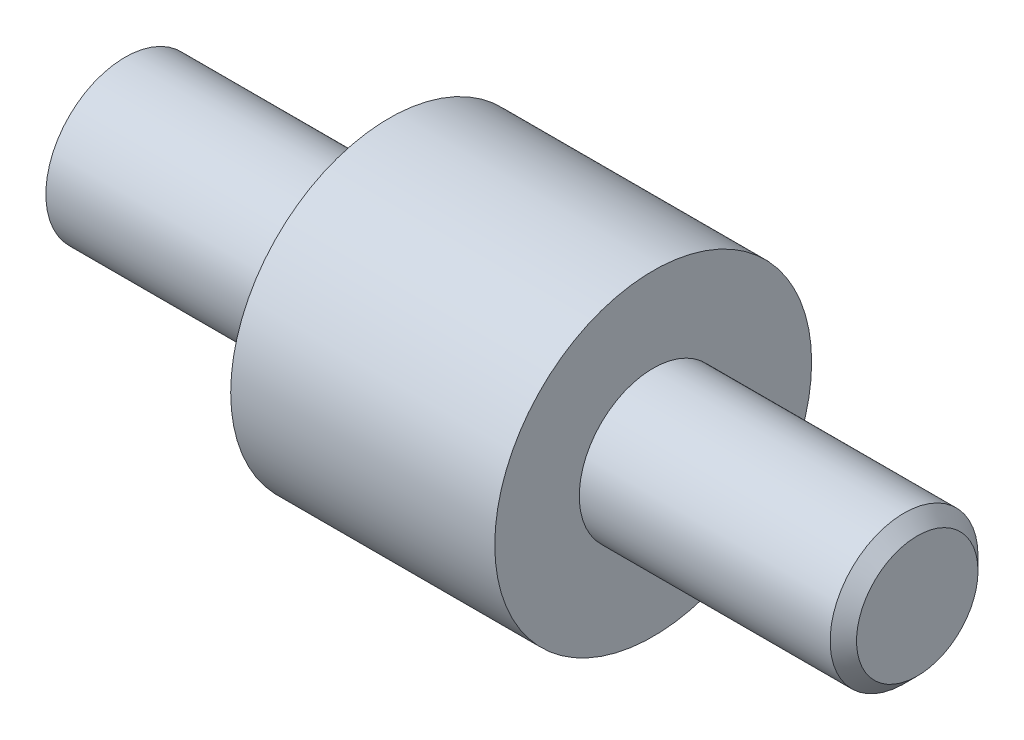
ISO-10303-21;
HEADER;
FILE_DESCRIPTION(('STEP AP214'),'2;1');
FILE_NAME('part.step','',(''),(''),'','','');
FILE_SCHEMA(('AUTOMOTIVE_DESIGN { 1 0 10303 214 1 1 1 1 }'));
ENDSEC;
DATA;
#1=APPLICATION_CONTEXT('core data for automotive mechanical design processes');
#2=APPLICATION_PROTOCOL_DEFINITION('international standard','automotive_design',2000,#1);
#3=PRODUCT_CONTEXT('',#1,'mechanical');
#4=PRODUCT('Part','Part','',(#3));
#5=PRODUCT_RELATED_PRODUCT_CATEGORY('part','',(#4));
#6=PRODUCT_DEFINITION_FORMATION('','',#4);
#7=PRODUCT_DEFINITION_CONTEXT('part definition',#1,'design');
#8=PRODUCT_DEFINITION('design','',#6,#7);
#9=PRODUCT_DEFINITION_SHAPE('','',#8);
#10=(LENGTH_UNIT() NAMED_UNIT(*) SI_UNIT(.MILLI.,.METRE.));
#11=(NAMED_UNIT(*) PLANE_ANGLE_UNIT() SI_UNIT($,.RADIAN.));
#12=(NAMED_UNIT(*) SI_UNIT($,.STERADIAN.) SOLID_ANGLE_UNIT());
#13=UNCERTAINTY_MEASURE_WITH_UNIT(LENGTH_MEASURE(1.E-05),#10,'distance_accuracy_value','');
#14=(GEOMETRIC_REPRESENTATION_CONTEXT(3) GLOBAL_UNCERTAINTY_ASSIGNED_CONTEXT((#13)) GLOBAL_UNIT_ASSIGNED_CONTEXT((#10,
#11,#12)) REPRESENTATION_CONTEXT('',''));
#15=CARTESIAN_POINT('',(0.,0.,0.));
#16=DIRECTION('',(0.,0.,1.));
#17=DIRECTION('',(1.,0.,0.));
#18=AXIS2_PLACEMENT_3D('',#15,#16,#17);
#19=CARTESIAN_POINT('',(0.,0.,0.));
#20=DIRECTION('',(-1.,0.,0.));
#21=DIRECTION('',(0.,0.,1.));
#22=AXIS2_PLACEMENT_3D('',#19,#20,#21);
#23=PLANE('',#22);
#24=CARTESIAN_POINT('',(0.,0.,0.));
#25=DIRECTION('',(1.,0.,0.));
#26=DIRECTION('',(0.,0.,-1.));
#27=AXIS2_PLACEMENT_3D('',#24,#25,#26);
#28=CIRCLE('',#27,1.5);
#29=CARTESIAN_POINT('',(0.,0.,-1.5));
#30=VERTEX_POINT('',#29);
#31=EDGE_CURVE('E45',#30,#30,#28,.T.);
#32=ORIENTED_EDGE('',*,*,#31,.F.);
#33=EDGE_LOOP('',(#32));
#34=FACE_BOUND('',#33,.T.);
#35=ADVANCED_FACE('F33',(#34),#23,.T.);
#36=CARTESIAN_POINT('',(15.,0.,0.));
#37=DIRECTION('',(1.,0.,0.));
#38=DIRECTION('',(0.,0.,-1.));
#39=AXIS2_PLACEMENT_3D('',#36,#37,#38);
#40=CYLINDRICAL_SURFACE('',#39,1.5);
#41=ORIENTED_EDGE('',*,*,#31,.T.);
#42=EDGE_LOOP('',(#41));
#43=FACE_BOUND('',#42,.T.);
#44=CARTESIAN_POINT('',(5.,0.,0.));
#45=DIRECTION('',(1.,0.,0.));
#46=DIRECTION('',(0.,0.,-1.));
#47=AXIS2_PLACEMENT_3D('',#44,#45,#46);
#48=CIRCLE('',#47,1.5);
#49=CARTESIAN_POINT('',(5.,0.,-1.5));
#50=VERTEX_POINT('',#49);
#51=EDGE_CURVE('E49',#50,#50,#48,.T.);
#52=ORIENTED_EDGE('',*,*,#51,.F.);
#53=EDGE_LOOP('',(#52));
#54=FACE_BOUND('',#53,.T.);
#55=ADVANCED_FACE('F81',(#43,#54),#40,.T.);
#56=CARTESIAN_POINT('',(5.,1.5,0.));
#57=DIRECTION('',(-1.,0.,0.));
#58=DIRECTION('',(0.,0.,1.));
#59=AXIS2_PLACEMENT_3D('',#56,#57,#58);
#60=PLANE('',#59);
#61=ORIENTED_EDGE('',*,*,#51,.T.);
#62=EDGE_LOOP('',(#61));
#63=FACE_BOUND('',#62,.T.);
#64=CARTESIAN_POINT('',(5.,0.,0.));
#65=DIRECTION('',(1.,0.,0.));
#66=DIRECTION('',(0.,0.,-1.));
#67=AXIS2_PLACEMENT_3D('',#64,#65,#66);
#68=CIRCLE('',#67,3.);
#69=CARTESIAN_POINT('',(5.,0.,-3.));
#70=VERTEX_POINT('',#69);
#71=EDGE_CURVE('E54',#70,#70,#68,.T.);
#72=ORIENTED_EDGE('',*,*,#71,.F.);
#73=EDGE_LOOP('',(#72));
#74=FACE_BOUND('',#73,.T.);
#75=ADVANCED_FACE('F77',(#63,#74),#60,.T.);
#76=CARTESIAN_POINT('',(15.,0.,0.));
#77=DIRECTION('',(1.,0.,0.));
#78=DIRECTION('',(0.,0.,-1.));
#79=AXIS2_PLACEMENT_3D('',#76,#77,#78);
#80=CYLINDRICAL_SURFACE('',#79,3.);
#81=ORIENTED_EDGE('',*,*,#71,.T.);
#82=EDGE_LOOP('',(#81));
#83=FACE_BOUND('',#82,.T.);
#84=CARTESIAN_POINT('',(10.,0.,0.));
#85=DIRECTION('',(1.,0.,0.));
#86=DIRECTION('',(0.,0.,-1.));
#87=AXIS2_PLACEMENT_3D('',#84,#85,#86);
#88=CIRCLE('',#87,3.);
#89=CARTESIAN_POINT('',(10.,0.,-3.));
#90=VERTEX_POINT('',#89);
#91=EDGE_CURVE('E57',#90,#90,#88,.T.);
#92=ORIENTED_EDGE('',*,*,#91,.F.);
#93=EDGE_LOOP('',(#92));
#94=FACE_BOUND('',#93,.T.);
#95=ADVANCED_FACE('F68',(#83,#94),#80,.T.);
#96=CARTESIAN_POINT('',(10.,3.,0.));
#97=DIRECTION('',(1.,0.,0.));
#98=DIRECTION('',(0.,0.,-1.));
#99=AXIS2_PLACEMENT_3D('',#96,#97,#98);
#100=PLANE('',#99);
#101=ORIENTED_EDGE('',*,*,#91,.T.);
#102=EDGE_LOOP('',(#101));
#103=FACE_BOUND('',#102,.T.);
#104=CARTESIAN_POINT('',(10.,0.,0.));
#105=DIRECTION('',(1.,0.,0.));
#106=DIRECTION('',(0.,0.,-1.));
#107=AXIS2_PLACEMENT_3D('',#104,#105,#106);
#108=CIRCLE('',#107,1.4);
#109=CARTESIAN_POINT('',(10.,0.,-1.4));
#110=VERTEX_POINT('',#109);
#111=EDGE_CURVE('E60',#110,#110,#108,.T.);
#112=ORIENTED_EDGE('',*,*,#111,.F.);
#113=EDGE_LOOP('',(#112));
#114=FACE_BOUND('',#113,.T.);
#115=ADVANCED_FACE('F66',(#103,#114),#100,.T.);
#116=CARTESIAN_POINT('',(15.,0.,0.));
#117=DIRECTION('',(1.,0.,0.));
#118=DIRECTION('',(0.,0.,-1.));
#119=AXIS2_PLACEMENT_3D('',#116,#117,#118);
#120=CYLINDRICAL_SURFACE('',#119,1.4);
#121=CARTESIAN_POINT('',(14.75,0.,0.));
#122=DIRECTION('',(1.,0.,0.));
#123=DIRECTION('',(0.,0.,-1.));
#124=AXIS2_PLACEMENT_3D('',#121,#122,#123);
#125=CIRCLE('',#124,1.4);
#126=CARTESIAN_POINT('',(14.75,0.,-1.4));
#127=VERTEX_POINT('',#126);
#128=EDGE_CURVE('E10',#127,#127,#125,.F.);
#129=ORIENTED_EDGE('',*,*,#128,.T.);
#130=EDGE_LOOP('',(#129));
#131=FACE_BOUND('',#130,.T.);
#132=ORIENTED_EDGE('',*,*,#111,.T.);
#133=EDGE_LOOP('',(#132));
#134=FACE_BOUND('',#133,.T.);
#135=ADVANCED_FACE('F64',(#131,#134),#120,.T.);
#136=CARTESIAN_POINT('',(15.,1.4,0.));
#137=DIRECTION('',(1.,0.,0.));
#138=DIRECTION('',(0.,0.,-1.));
#139=AXIS2_PLACEMENT_3D('',#136,#137,#138);
#140=PLANE('',#139);
#141=CARTESIAN_POINT('',(15.,0.,0.));
#142=DIRECTION('',(1.,0.,0.));
#143=DIRECTION('',(0.,0.,-1.));
#144=AXIS2_PLACEMENT_3D('',#141,#142,#143);
#145=CIRCLE('',#144,1.15);
#146=CARTESIAN_POINT('',(15.,0.,-1.15));
#147=VERTEX_POINT('',#146);
#148=EDGE_CURVE('E41',#147,#147,#145,.T.);
#149=ORIENTED_EDGE('',*,*,#148,.T.);
#150=EDGE_LOOP('',(#149));
#151=FACE_BOUND('',#150,.T.);
#152=ADVANCED_FACE('F75',(#151),#140,.T.);
#153=CARTESIAN_POINT('',(15.,0.,0.));
#154=DIRECTION('',(-1.,0.,0.));
#155=DIRECTION('',(0.,0.,1.));
#156=AXIS2_PLACEMENT_3D('',#153,#154,#155);
#157=CONICAL_SURFACE('',#156,1.15,0.785398163397448);
#158=ORIENTED_EDGE('',*,*,#128,.F.);
#159=EDGE_LOOP('',(#158));
#160=FACE_BOUND('',#159,.T.);
#161=ORIENTED_EDGE('',*,*,#148,.F.);
#162=EDGE_LOOP('',(#161));
#163=FACE_BOUND('',#162,.T.);
#164=ADVANCED_FACE('F36',(#160,#163),#157,.T.);
#165=CLOSED_SHELL('',(#35,#55,#75,#95,#115,#135,#152,#164));
#166=MANIFOLD_SOLID_BREP('B2',#165);
#167=ADVANCED_BREP_SHAPE_REPRESENTATION('',(#18,#166),#14);
#168=SHAPE_DEFINITION_REPRESENTATION(#9,#167);
ENDSEC;
END-ISO-10303-21;
